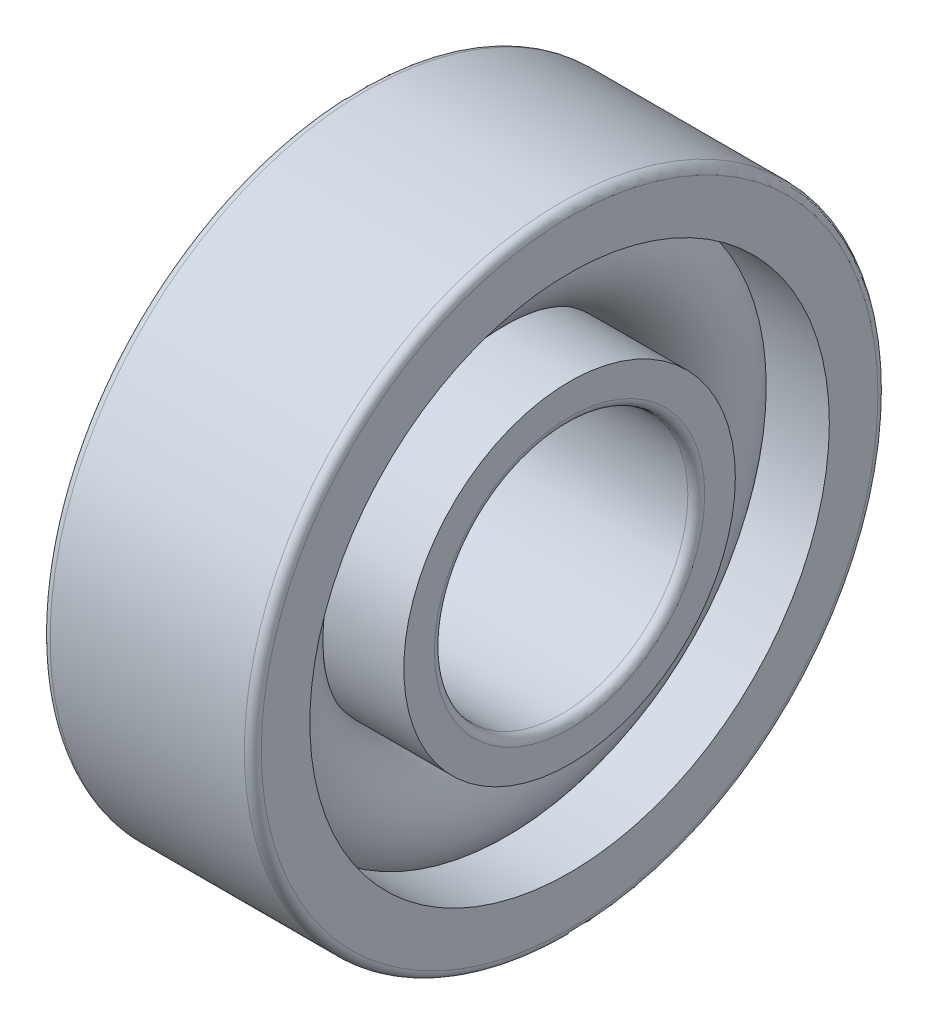
ISO-10303-21;
HEADER;
FILE_DESCRIPTION(('STEP AP214'),'2;1');
FILE_NAME('part.step','',(''),(''),'','','');
FILE_SCHEMA(('AUTOMOTIVE_DESIGN { 1 0 10303 214 1 1 1 1 }'));
ENDSEC;
DATA;
#1=APPLICATION_CONTEXT('core data for automotive mechanical design processes');
#2=APPLICATION_PROTOCOL_DEFINITION('international standard','automotive_design',2000,#1);
#3=PRODUCT_CONTEXT('',#1,'mechanical');
#4=PRODUCT('Part','Part','',(#3));
#5=PRODUCT_RELATED_PRODUCT_CATEGORY('part','',(#4));
#6=PRODUCT_DEFINITION_FORMATION('','',#4);
#7=PRODUCT_DEFINITION_CONTEXT('part definition',#1,'design');
#8=PRODUCT_DEFINITION('design','',#6,#7);
#9=PRODUCT_DEFINITION_SHAPE('','',#8);
#10=(LENGTH_UNIT() NAMED_UNIT(*) SI_UNIT(.MILLI.,.METRE.));
#11=(NAMED_UNIT(*) PLANE_ANGLE_UNIT() SI_UNIT($,.RADIAN.));
#12=(NAMED_UNIT(*) SI_UNIT($,.STERADIAN.) SOLID_ANGLE_UNIT());
#13=UNCERTAINTY_MEASURE_WITH_UNIT(LENGTH_MEASURE(1.E-05),#10,'distance_accuracy_value','');
#14=(GEOMETRIC_REPRESENTATION_CONTEXT(3) GLOBAL_UNCERTAINTY_ASSIGNED_CONTEXT((#13)) GLOBAL_UNIT_ASSIGNED_CONTEXT((#10,
#11,#12)) REPRESENTATION_CONTEXT('',''));
#15=CARTESIAN_POINT('',(0.,0.,0.));
#16=DIRECTION('',(0.,0.,1.));
#17=DIRECTION('',(1.,0.,0.));
#18=AXIS2_PLACEMENT_3D('',#15,#16,#17);
#19=CARTESIAN_POINT('',(0.,0.,0.));
#20=DIRECTION('',(-1.,0.,0.));
#21=DIRECTION('',(0.,0.,1.));
#22=AXIS2_PLACEMENT_3D('',#19,#20,#21);
#23=TOROIDAL_SURFACE('',#22,5.25,1.35);
#24=CARTESIAN_POINT('',(1.00623058987491,0.,0.));
#25=DIRECTION('',(-1.,0.,0.));
#26=DIRECTION('',(0.,0.,1.));
#27=AXIS2_PLACEMENT_3D('',#24,#25,#26);
#28=CIRCLE('',#27,6.15);
#29=CARTESIAN_POINT('',(1.00623058987491,0.,6.15));
#30=VERTEX_POINT('',#29);
#31=EDGE_CURVE('E37',#30,#30,#28,.F.);
#32=ORIENTED_EDGE('',*,*,#31,.T.);
#33=EDGE_LOOP('',(#32));
#34=FACE_BOUND('',#33,.T.);
#35=CARTESIAN_POINT('',(0.258602010819712,0.,0.));
#36=DIRECTION('',(-1.,0.,0.));
#37=DIRECTION('',(0.,0.,1.));
#38=AXIS2_PLACEMENT_3D('',#35,#36,#37);
#39=CIRCLE('',#38,3.925);
#40=CARTESIAN_POINT('',(0.258602010819712,0.,3.925));
#41=VERTEX_POINT('',#40);
#42=EDGE_CURVE('E10',#41,#41,#39,.T.);
#43=ORIENTED_EDGE('',*,*,#42,.T.);
#44=EDGE_LOOP('',(#43));
#45=FACE_BOUND('',#44,.T.);
#46=ADVANCED_FACE('F33',(#34,#45),#23,.T.);
#47=CARTESIAN_POINT('',(-20.6375,0.,0.));
#48=DIRECTION('',(1.,0.,0.));
#49=DIRECTION('',(0.,0.,-1.));
#50=AXIS2_PLACEMENT_3D('',#47,#48,#49);
#51=CYLINDRICAL_SURFACE('',#50,3.925);
#52=CARTESIAN_POINT('',(2.5,0.,0.));
#53=DIRECTION('',(1.,0.,0.));
#54=DIRECTION('',(0.,0.,-1.));
#55=AXIS2_PLACEMENT_3D('',#52,#53,#54);
#56=CIRCLE('',#55,3.925);
#57=CARTESIAN_POINT('',(2.5,0.,-3.925));
#58=VERTEX_POINT('',#57);
#59=EDGE_CURVE('E46',#58,#58,#56,.T.);
#60=ORIENTED_EDGE('',*,*,#59,.F.);
#61=EDGE_LOOP('',(#60));
#62=FACE_BOUND('',#61,.T.);
#63=ORIENTED_EDGE('',*,*,#42,.F.);
#64=EDGE_LOOP('',(#63));
#65=FACE_BOUND('',#64,.T.);
#66=ADVANCED_FACE('F85',(#62,#65),#51,.T.);
#67=CARTESIAN_POINT('',(-20.6375,0.,0.));
#68=DIRECTION('',(1.,0.,0.));
#69=DIRECTION('',(0.,0.,-1.));
#70=AXIS2_PLACEMENT_3D('',#67,#68,#69);
#71=CYLINDRICAL_SURFACE('',#70,4.35);
#72=CARTESIAN_POINT('',(-2.5,0.,0.));
#73=DIRECTION('',(1.,0.,0.));
#74=DIRECTION('',(0.,0.,-1.));
#75=AXIS2_PLACEMENT_3D('',#72,#73,#74);
#76=CIRCLE('',#75,4.35);
#77=CARTESIAN_POINT('',(-2.5,0.,-4.35));
#78=VERTEX_POINT('',#77);
#79=EDGE_CURVE('E55',#78,#78,#76,.T.);
#80=ORIENTED_EDGE('',*,*,#79,.T.);
#81=EDGE_LOOP('',(#80));
#82=FACE_BOUND('',#81,.T.);
#83=CARTESIAN_POINT('',(-1.0062305898749,0.,0.));
#84=DIRECTION('',(1.,0.,0.));
#85=DIRECTION('',(0.,0.,-1.));
#86=AXIS2_PLACEMENT_3D('',#83,#84,#85);
#87=CIRCLE('',#86,4.35);
#88=CARTESIAN_POINT('',(-1.0062305898749,0.,-4.35));
#89=VERTEX_POINT('',#88);
#90=EDGE_CURVE('E41',#89,#89,#87,.T.);
#91=ORIENTED_EDGE('',*,*,#90,.F.);
#92=EDGE_LOOP('',(#91));
#93=FACE_BOUND('',#92,.T.);
#94=ADVANCED_FACE('F88',(#82,#93),#71,.T.);
#95=CARTESIAN_POINT('',(2.5,3.2,0.));
#96=DIRECTION('',(1.,0.,0.));
#97=DIRECTION('',(0.,0.,-1.));
#98=AXIS2_PLACEMENT_3D('',#95,#96,#97);
#99=PLANE('',#98);
#100=ORIENTED_EDGE('',*,*,#59,.T.);
#101=EDGE_LOOP('',(#100));
#102=FACE_BOUND('',#101,.T.);
#103=CARTESIAN_POINT('',(2.5,0.,0.));
#104=DIRECTION('',(1.,0.,0.));
#105=DIRECTION('',(0.,0.,-1.));
#106=AXIS2_PLACEMENT_3D('',#103,#104,#105);
#107=CIRCLE('',#106,3.2);
#108=CARTESIAN_POINT('',(2.5,0.,-3.2));
#109=VERTEX_POINT('',#108);
#110=EDGE_CURVE('E77',#109,#109,#107,.T.);
#111=ORIENTED_EDGE('',*,*,#110,.F.);
#112=EDGE_LOOP('',(#111));
#113=FACE_BOUND('',#112,.T.);
#114=ADVANCED_FACE('F82',(#102,#113),#99,.T.);
#115=CARTESIAN_POINT('',(2.3,0.,0.));
#116=DIRECTION('',(1.,0.,0.));
#117=DIRECTION('',(0.,0.,-1.));
#118=AXIS2_PLACEMENT_3D('',#115,#116,#117);
#119=TOROIDAL_SURFACE('',#118,3.2,0.2);
#120=ORIENTED_EDGE('',*,*,#110,.T.);
#121=EDGE_LOOP('',(#120));
#122=FACE_BOUND('',#121,.T.);
#123=CARTESIAN_POINT('',(2.3,0.,0.));
#124=DIRECTION('',(1.,0.,0.));
#125=DIRECTION('',(0.,0.,-1.));
#126=AXIS2_PLACEMENT_3D('',#123,#124,#125);
#127=CIRCLE('',#126,3.);
#128=CARTESIAN_POINT('',(2.3,0.,-3.));
#129=VERTEX_POINT('',#128);
#130=EDGE_CURVE('E74',#129,#129,#127,.T.);
#131=ORIENTED_EDGE('',*,*,#130,.F.);
#132=EDGE_LOOP('',(#131));
#133=FACE_BOUND('',#132,.T.);
#134=ADVANCED_FACE('F99',(#122,#133),#119,.T.);
#135=CARTESIAN_POINT('',(-20.6375,0.,0.));
#136=DIRECTION('',(1.,0.,0.));
#137=DIRECTION('',(0.,0.,-1.));
#138=AXIS2_PLACEMENT_3D('',#135,#136,#137);
#139=CYLINDRICAL_SURFACE('',#138,3.);
#140=ORIENTED_EDGE('',*,*,#130,.T.);
#141=EDGE_LOOP('',(#140));
#142=FACE_BOUND('',#141,.T.);
#143=CARTESIAN_POINT('',(-2.3,0.,0.));
#144=DIRECTION('',(1.,0.,0.));
#145=DIRECTION('',(0.,0.,-1.));
#146=AXIS2_PLACEMENT_3D('',#143,#144,#145);
#147=CIRCLE('',#146,3.);
#148=CARTESIAN_POINT('',(-2.3,0.,-3.));
#149=VERTEX_POINT('',#148);
#150=EDGE_CURVE('E71',#149,#149,#147,.T.);
#151=ORIENTED_EDGE('',*,*,#150,.F.);
#152=EDGE_LOOP('',(#151));
#153=FACE_BOUND('',#152,.T.);
#154=ADVANCED_FACE('F102',(#142,#153),#139,.F.);
#155=CARTESIAN_POINT('',(-2.3,0.,0.));
#156=DIRECTION('',(1.,0.,0.));
#157=DIRECTION('',(0.,0.,-1.));
#158=AXIS2_PLACEMENT_3D('',#155,#156,#157);
#159=TOROIDAL_SURFACE('',#158,3.2,0.2);
#160=ORIENTED_EDGE('',*,*,#150,.T.);
#161=EDGE_LOOP('',(#160));
#162=FACE_BOUND('',#161,.T.);
#163=CARTESIAN_POINT('',(-2.5,0.,0.));
#164=DIRECTION('',(1.,0.,0.));
#165=DIRECTION('',(0.,0.,-1.));
#166=AXIS2_PLACEMENT_3D('',#163,#164,#165);
#167=CIRCLE('',#166,3.2);
#168=CARTESIAN_POINT('',(-2.5,0.,-3.2));
#169=VERTEX_POINT('',#168);
#170=EDGE_CURVE('E68',#169,#169,#167,.T.);
#171=ORIENTED_EDGE('',*,*,#170,.F.);
#172=EDGE_LOOP('',(#171));
#173=FACE_BOUND('',#172,.T.);
#174=ADVANCED_FACE('F106',(#162,#173),#159,.T.);
#175=CARTESIAN_POINT('',(-2.5,4.35,0.));
#176=DIRECTION('',(-1.,0.,0.));
#177=DIRECTION('',(0.,0.,1.));
#178=AXIS2_PLACEMENT_3D('',#175,#176,#177);
#179=PLANE('',#178);
#180=ORIENTED_EDGE('',*,*,#170,.T.);
#181=EDGE_LOOP('',(#180));
#182=FACE_BOUND('',#181,.T.);
#183=ORIENTED_EDGE('',*,*,#79,.F.);
#184=EDGE_LOOP('',(#183));
#185=FACE_BOUND('',#184,.T.);
#186=ADVANCED_FACE('F110',(#182,#185),#179,.T.);
#187=CARTESIAN_POINT('',(-0.258602010819712,0.,0.));
#188=DIRECTION('',(1.,0.,0.));
#189=DIRECTION('',(0.,0.,-1.));
#190=AXIS2_PLACEMENT_3D('',#187,#188,#189);
#191=CIRCLE('',#190,6.575);
#192=CARTESIAN_POINT('',(-0.258602010819712,0.,-6.575));
#193=VERTEX_POINT('',#192);
#194=EDGE_CURVE('E49',#193,#193,#191,.F.);
#195=ORIENTED_EDGE('',*,*,#194,.T.);
#196=EDGE_LOOP('',(#195));
#197=FACE_BOUND('',#196,.T.);
#198=ORIENTED_EDGE('',*,*,#90,.T.);
#199=EDGE_LOOP('',(#198));
#200=FACE_BOUND('',#199,.T.);
#201=ADVANCED_FACE('F35',(#197,#200),#23,.T.);
#202=CARTESIAN_POINT('',(-20.6375,0.,0.));
#203=DIRECTION('',(1.,0.,0.));
#204=DIRECTION('',(0.,0.,-1.));
#205=AXIS2_PLACEMENT_3D('',#202,#203,#204);
#206=CYLINDRICAL_SURFACE('',#205,6.15);
#207=CARTESIAN_POINT('',(2.5,0.,0.));
#208=DIRECTION('',(1.,0.,0.));
#209=DIRECTION('',(0.,0.,-1.));
#210=AXIS2_PLACEMENT_3D('',#207,#208,#209);
#211=CIRCLE('',#210,6.15);
#212=CARTESIAN_POINT('',(2.5,0.,-6.15));
#213=VERTEX_POINT('',#212);
#214=EDGE_CURVE('E151',#213,#213,#211,.T.);
#215=ORIENTED_EDGE('',*,*,#214,.T.);
#216=EDGE_LOOP('',(#215));
#217=FACE_BOUND('',#216,.T.);
#218=ORIENTED_EDGE('',*,*,#31,.F.);
#219=EDGE_LOOP('',(#218));
#220=FACE_BOUND('',#219,.T.);
#221=ADVANCED_FACE('F132',(#217,#220),#206,.F.);
#222=CARTESIAN_POINT('',(-20.6375,0.,0.));
#223=DIRECTION('',(1.,0.,0.));
#224=DIRECTION('',(0.,0.,-1.));
#225=AXIS2_PLACEMENT_3D('',#222,#223,#224);
#226=CYLINDRICAL_SURFACE('',#225,6.575);
#227=CARTESIAN_POINT('',(-2.5,0.,0.));
#228=DIRECTION('',(1.,0.,0.));
#229=DIRECTION('',(0.,0.,-1.));
#230=AXIS2_PLACEMENT_3D('',#227,#228,#229);
#231=CIRCLE('',#230,6.575);
#232=CARTESIAN_POINT('',(-2.5,0.,-6.575));
#233=VERTEX_POINT('',#232);
#234=EDGE_CURVE('E146',#233,#233,#231,.T.);
#235=ORIENTED_EDGE('',*,*,#234,.F.);
#236=EDGE_LOOP('',(#235));
#237=FACE_BOUND('',#236,.T.);
#238=ORIENTED_EDGE('',*,*,#194,.F.);
#239=EDGE_LOOP('',(#238));
#240=FACE_BOUND('',#239,.T.);
#241=ADVANCED_FACE('F119',(#237,#240),#226,.F.);
#242=CARTESIAN_POINT('',(-2.3,0.,0.));
#243=DIRECTION('',(1.,0.,0.));
#244=DIRECTION('',(0.,0.,-1.));
#245=AXIS2_PLACEMENT_3D('',#242,#243,#244);
#246=TOROIDAL_SURFACE('',#245,7.3,0.200000000000001);
#247=CARTESIAN_POINT('',(-2.5,0.,0.));
#248=DIRECTION('',(1.,0.,0.));
#249=DIRECTION('',(0.,0.,-1.));
#250=AXIS2_PLACEMENT_3D('',#247,#248,#249);
#251=CIRCLE('',#250,7.3);
#252=CARTESIAN_POINT('',(-2.5,0.,-7.3));
#253=VERTEX_POINT('',#252);
#254=EDGE_CURVE('E149',#253,#253,#251,.T.);
#255=ORIENTED_EDGE('',*,*,#254,.T.);
#256=EDGE_LOOP('',(#255));
#257=FACE_BOUND('',#256,.T.);
#258=CARTESIAN_POINT('',(-2.3,0.,0.));
#259=DIRECTION('',(1.,0.,0.));
#260=DIRECTION('',(0.,0.,-1.));
#261=AXIS2_PLACEMENT_3D('',#258,#259,#260);
#262=CIRCLE('',#261,7.5);
#263=CARTESIAN_POINT('',(-2.3,0.,-7.5));
#264=VERTEX_POINT('',#263);
#265=EDGE_CURVE('E51',#264,#264,#262,.T.);
#266=ORIENTED_EDGE('',*,*,#265,.F.);
#267=EDGE_LOOP('',(#266));
#268=FACE_BOUND('',#267,.T.);
#269=ADVANCED_FACE('F115',(#257,#268),#246,.T.);
#270=CARTESIAN_POINT('',(-20.6375,0.,0.));
#271=DIRECTION('',(1.,0.,0.));
#272=DIRECTION('',(0.,0.,-1.));
#273=AXIS2_PLACEMENT_3D('',#270,#271,#272);
#274=CYLINDRICAL_SURFACE('',#273,7.5);
#275=ORIENTED_EDGE('',*,*,#265,.T.);
#276=EDGE_LOOP('',(#275));
#277=FACE_BOUND('',#276,.T.);
#278=CARTESIAN_POINT('',(2.3,0.,0.));
#279=DIRECTION('',(1.,0.,0.));
#280=DIRECTION('',(0.,0.,-1.));
#281=AXIS2_PLACEMENT_3D('',#278,#279,#280);
#282=CIRCLE('',#281,7.5);
#283=CARTESIAN_POINT('',(2.3,0.,-7.5));
#284=VERTEX_POINT('',#283);
#285=EDGE_CURVE('E57',#284,#284,#282,.T.);
#286=ORIENTED_EDGE('',*,*,#285,.F.);
#287=EDGE_LOOP('',(#286));
#288=FACE_BOUND('',#287,.T.);
#289=ADVANCED_FACE('F118',(#277,#288),#274,.T.);
#290=CARTESIAN_POINT('',(2.3,0.,0.));
#291=DIRECTION('',(1.,0.,0.));
#292=DIRECTION('',(0.,0.,-1.));
#293=AXIS2_PLACEMENT_3D('',#290,#291,#292);
#294=TOROIDAL_SURFACE('',#293,7.3,0.200000000000001);
#295=ORIENTED_EDGE('',*,*,#285,.T.);
#296=EDGE_LOOP('',(#295));
#297=FACE_BOUND('',#296,.T.);
#298=CARTESIAN_POINT('',(2.5,0.,0.));
#299=DIRECTION('',(1.,0.,0.));
#300=DIRECTION('',(0.,0.,-1.));
#301=AXIS2_PLACEMENT_3D('',#298,#299,#300);
#302=CIRCLE('',#301,7.3);
#303=CARTESIAN_POINT('',(2.5,0.,-7.3));
#304=VERTEX_POINT('',#303);
#305=EDGE_CURVE('E62',#304,#304,#302,.T.);
#306=ORIENTED_EDGE('',*,*,#305,.F.);
#307=EDGE_LOOP('',(#306));
#308=FACE_BOUND('',#307,.T.);
#309=ADVANCED_FACE('F123',(#297,#308),#294,.T.);
#310=CARTESIAN_POINT('',(2.5,7.3,0.));
#311=DIRECTION('',(1.,0.,0.));
#312=DIRECTION('',(0.,0.,-1.));
#313=AXIS2_PLACEMENT_3D('',#310,#311,#312);
#314=PLANE('',#313);
#315=ORIENTED_EDGE('',*,*,#305,.T.);
#316=EDGE_LOOP('',(#315));
#317=FACE_BOUND('',#316,.T.);
#318=ORIENTED_EDGE('',*,*,#214,.F.);
#319=EDGE_LOOP('',(#318));
#320=FACE_BOUND('',#319,.T.);
#321=ADVANCED_FACE('F126',(#317,#320),#314,.T.);
#322=CARTESIAN_POINT('',(-2.5,6.575,0.));
#323=DIRECTION('',(-1.,0.,0.));
#324=DIRECTION('',(0.,0.,1.));
#325=AXIS2_PLACEMENT_3D('',#322,#323,#324);
#326=PLANE('',#325);
#327=ORIENTED_EDGE('',*,*,#234,.T.);
#328=EDGE_LOOP('',(#327));
#329=FACE_BOUND('',#328,.T.);
#330=ORIENTED_EDGE('',*,*,#254,.F.);
#331=EDGE_LOOP('',(#330));
#332=FACE_BOUND('',#331,.T.);
#333=ADVANCED_FACE('F130',(#329,#332),#326,.T.);
#334=CLOSED_SHELL('',(#46,#66,#94,#114,#134,#154,#174,#186,#201,#221,#241,#269,#289,#309,#321,#333));
#335=MANIFOLD_SOLID_BREP('B2',#334);
#336=ADVANCED_BREP_SHAPE_REPRESENTATION('',(#18,#335),#14);
#337=SHAPE_DEFINITION_REPRESENTATION(#9,#336);
ENDSEC;
END-ISO-10303-21;
